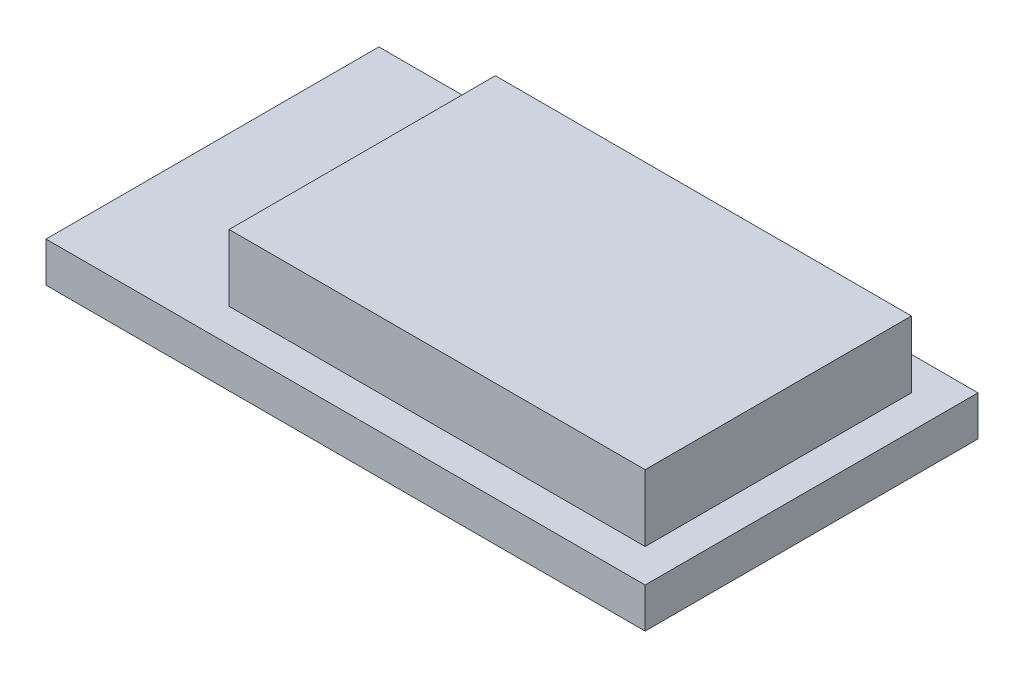
ISO-10303-21;
HEADER;
FILE_DESCRIPTION(('STEP AP214'),'2;1');
FILE_NAME('part.step','',(''),(''),'','','');
FILE_SCHEMA(('AUTOMOTIVE_DESIGN { 1 0 10303 214 1 1 1 1 }'));
ENDSEC;
DATA;
#1=APPLICATION_CONTEXT('core data for automotive mechanical design processes');
#2=APPLICATION_PROTOCOL_DEFINITION('international standard','automotive_design',2000,#1);
#3=PRODUCT_CONTEXT('',#1,'mechanical');
#4=PRODUCT('Part','Part','',(#3));
#5=PRODUCT_RELATED_PRODUCT_CATEGORY('part','',(#4));
#6=PRODUCT_DEFINITION_FORMATION('','',#4);
#7=PRODUCT_DEFINITION_CONTEXT('part definition',#1,'design');
#8=PRODUCT_DEFINITION('design','',#6,#7);
#9=PRODUCT_DEFINITION_SHAPE('','',#8);
#10=(LENGTH_UNIT() NAMED_UNIT(*) SI_UNIT(.MILLI.,.METRE.));
#11=(NAMED_UNIT(*) PLANE_ANGLE_UNIT() SI_UNIT($,.RADIAN.));
#12=(NAMED_UNIT(*) SI_UNIT($,.STERADIAN.) SOLID_ANGLE_UNIT());
#13=UNCERTAINTY_MEASURE_WITH_UNIT(LENGTH_MEASURE(1.E-05),#10,'distance_accuracy_value','');
#14=(GEOMETRIC_REPRESENTATION_CONTEXT(3) GLOBAL_UNCERTAINTY_ASSIGNED_CONTEXT((#13)) GLOBAL_UNIT_ASSIGNED_CONTEXT((#10,
#11,#12)) REPRESENTATION_CONTEXT('',''));
#15=CARTESIAN_POINT('',(0.,0.,0.));
#16=DIRECTION('',(0.,0.,1.));
#17=DIRECTION('',(1.,0.,0.));
#18=AXIS2_PLACEMENT_3D('',#15,#16,#17);
#19=CARTESIAN_POINT('',(0.,0.,0.));
#20=DIRECTION('',(0.,-1.,0.));
#21=DIRECTION('',(0.,0.,-1.));
#22=AXIS2_PLACEMENT_3D('',#19,#20,#21);
#23=PLANE('',#22);
#24=DIRECTION('',(0.,0.,1.));
#25=VECTOR('',#24,1.);
#26=CARTESIAN_POINT('',(-9.,0.,-5.));
#27=LINE('',#26,#25);
#28=CARTESIAN_POINT('',(-9.,0.,-5.));
#29=VERTEX_POINT('',#28);
#30=CARTESIAN_POINT('',(-9.,0.,5.));
#31=VERTEX_POINT('',#30);
#32=EDGE_CURVE('E120',#29,#31,#27,.T.);
#33=ORIENTED_EDGE('',*,*,#32,.T.);
#34=DIRECTION('',(1.,0.,0.));
#35=VECTOR('',#34,1.);
#36=CARTESIAN_POINT('',(9.,0.,5.));
#37=LINE('',#36,#35);
#38=CARTESIAN_POINT('',(9.,0.,5.));
#39=VERTEX_POINT('',#38);
#40=EDGE_CURVE('E123',#31,#39,#37,.T.);
#41=ORIENTED_EDGE('',*,*,#40,.T.);
#42=DIRECTION('',(0.,0.,-1.));
#43=VECTOR('',#42,1.);
#44=CARTESIAN_POINT('',(9.,0.,-5.));
#45=LINE('',#44,#43);
#46=CARTESIAN_POINT('',(9.,0.,-5.));
#47=VERTEX_POINT('',#46);
#48=EDGE_CURVE('E144',#39,#47,#45,.T.);
#49=ORIENTED_EDGE('',*,*,#48,.T.);
#50=DIRECTION('',(-1.,0.,0.));
#51=VECTOR('',#50,1.);
#52=CARTESIAN_POINT('',(9.,0.,-5.));
#53=LINE('',#52,#51);
#54=EDGE_CURVE('E133',#47,#29,#53,.T.);
#55=ORIENTED_EDGE('',*,*,#54,.T.);
#56=EDGE_LOOP('',(#33,#41,#49,#55));
#57=FACE_BOUND('',#56,.T.);
#58=DIRECTION('',(-1.,0.,0.));
#59=VECTOR('',#58,1.);
#60=CARTESIAN_POINT('',(8.,0.,-4.));
#61=LINE('',#60,#59);
#62=CARTESIAN_POINT('',(8.,0.,-4.));
#63=VERTEX_POINT('',#62);
#64=CARTESIAN_POINT('',(-4.5,0.,-4.));
#65=VERTEX_POINT('',#64);
#66=EDGE_CURVE('E119',#63,#65,#61,.T.);
#67=ORIENTED_EDGE('',*,*,#66,.F.);
#68=DIRECTION('',(0.,0.,-1.));
#69=VECTOR('',#68,1.);
#70=CARTESIAN_POINT('',(8.,0.,4.));
#71=LINE('',#70,#69);
#72=CARTESIAN_POINT('',(8.00000000000001,0.,4.));
#73=VERTEX_POINT('',#72);
#74=EDGE_CURVE('E116',#73,#63,#71,.T.);
#75=ORIENTED_EDGE('',*,*,#74,.F.);
#76=DIRECTION('',(1.,0.,0.));
#77=VECTOR('',#76,1.);
#78=CARTESIAN_POINT('',(-4.5,0.,4.));
#79=LINE('',#78,#77);
#80=CARTESIAN_POINT('',(-4.5,0.,4.));
#81=VERTEX_POINT('',#80);
#82=EDGE_CURVE('E55',#81,#73,#79,.T.);
#83=ORIENTED_EDGE('',*,*,#82,.F.);
#84=DIRECTION('',(0.,0.,1.));
#85=VECTOR('',#84,1.);
#86=CARTESIAN_POINT('',(-4.5,0.,-4.));
#87=LINE('',#86,#85);
#88=EDGE_CURVE('E50',#65,#81,#87,.T.);
#89=ORIENTED_EDGE('',*,*,#88,.F.);
#90=EDGE_LOOP('',(#67,#75,#83,#89));
#91=FACE_BOUND('',#90,.T.);
#92=ADVANCED_FACE('F33',(#57,#91),#23,.F.);
#93=CARTESIAN_POINT('',(-9.,-1.2,-5.));
#94=DIRECTION('',(-1.,0.,0.));
#95=DIRECTION('',(0.,0.,1.));
#96=AXIS2_PLACEMENT_3D('',#93,#94,#95);
#97=PLANE('',#96);
#98=ORIENTED_EDGE('',*,*,#32,.F.);
#99=DIRECTION('',(0.,1.,0.));
#100=VECTOR('',#99,1.);
#101=CARTESIAN_POINT('',(-9.,-1.2,-5.));
#102=LINE('',#101,#100);
#103=CARTESIAN_POINT('',(-9.,-1.2,-5.));
#104=VERTEX_POINT('',#103);
#105=EDGE_CURVE('E11',#104,#29,#102,.T.);
#106=ORIENTED_EDGE('',*,*,#105,.F.);
#107=DIRECTION('',(0.,0.,1.));
#108=VECTOR('',#107,1.);
#109=CARTESIAN_POINT('',(-9.,-1.2,-5.));
#110=LINE('',#109,#108);
#111=CARTESIAN_POINT('',(-9.,-1.2,5.));
#112=VERTEX_POINT('',#111);
#113=EDGE_CURVE('E129',#104,#112,#110,.T.);
#114=ORIENTED_EDGE('',*,*,#113,.T.);
#115=DIRECTION('',(0.,1.,0.));
#116=VECTOR('',#115,1.);
#117=CARTESIAN_POINT('',(-9.,-1.2,5.));
#118=LINE('',#117,#116);
#119=EDGE_CURVE('E37',#112,#31,#118,.T.);
#120=ORIENTED_EDGE('',*,*,#119,.T.);
#121=EDGE_LOOP('',(#98,#106,#114,#120));
#122=FACE_BOUND('',#121,.T.);
#123=ADVANCED_FACE('F35',(#122),#97,.T.);
#124=CARTESIAN_POINT('',(9.,-1.2,-5.));
#125=DIRECTION('',(0.,0.,-1.));
#126=DIRECTION('',(-1.,0.,0.));
#127=AXIS2_PLACEMENT_3D('',#124,#125,#126);
#128=PLANE('',#127);
#129=ORIENTED_EDGE('',*,*,#54,.F.);
#130=DIRECTION('',(0.,1.,0.));
#131=VECTOR('',#130,1.);
#132=CARTESIAN_POINT('',(9.,-1.2,-5.));
#133=LINE('',#132,#131);
#134=CARTESIAN_POINT('',(9.,-1.2,-5.));
#135=VERTEX_POINT('',#134);
#136=EDGE_CURVE('E42',#135,#47,#133,.T.);
#137=ORIENTED_EDGE('',*,*,#136,.F.);
#138=DIRECTION('',(-1.,0.,0.));
#139=VECTOR('',#138,1.);
#140=CARTESIAN_POINT('',(9.,-1.2,-5.));
#141=LINE('',#140,#139);
#142=EDGE_CURVE('E139',#135,#104,#141,.T.);
#143=ORIENTED_EDGE('',*,*,#142,.T.);
#144=ORIENTED_EDGE('',*,*,#105,.T.);
#145=EDGE_LOOP('',(#129,#137,#143,#144));
#146=FACE_BOUND('',#145,.T.);
#147=ADVANCED_FACE('F161',(#146),#128,.T.);
#148=CARTESIAN_POINT('',(9.,-1.2,-5.));
#149=DIRECTION('',(1.,0.,0.));
#150=DIRECTION('',(0.,0.,-1.));
#151=AXIS2_PLACEMENT_3D('',#148,#149,#150);
#152=PLANE('',#151);
#153=ORIENTED_EDGE('',*,*,#48,.F.);
#154=DIRECTION('',(0.,1.,0.));
#155=VECTOR('',#154,1.);
#156=CARTESIAN_POINT('',(9.,-1.2,5.));
#157=LINE('',#156,#155);
#158=CARTESIAN_POINT('',(9.,-1.2,5.));
#159=VERTEX_POINT('',#158);
#160=EDGE_CURVE('E149',#159,#39,#157,.T.);
#161=ORIENTED_EDGE('',*,*,#160,.F.);
#162=DIRECTION('',(0.,0.,-1.));
#163=VECTOR('',#162,1.);
#164=CARTESIAN_POINT('',(9.,-1.2,-5.));
#165=LINE('',#164,#163);
#166=EDGE_CURVE('E136',#159,#135,#165,.T.);
#167=ORIENTED_EDGE('',*,*,#166,.T.);
#168=ORIENTED_EDGE('',*,*,#136,.T.);
#169=EDGE_LOOP('',(#153,#161,#167,#168));
#170=FACE_BOUND('',#169,.T.);
#171=ADVANCED_FACE('F167',(#170),#152,.T.);
#172=CARTESIAN_POINT('',(9.,-1.2,5.));
#173=DIRECTION('',(0.,0.,1.));
#174=DIRECTION('',(1.,0.,0.));
#175=AXIS2_PLACEMENT_3D('',#172,#173,#174);
#176=PLANE('',#175);
#177=ORIENTED_EDGE('',*,*,#40,.F.);
#178=ORIENTED_EDGE('',*,*,#119,.F.);
#179=DIRECTION('',(1.,0.,0.));
#180=VECTOR('',#179,1.);
#181=CARTESIAN_POINT('',(9.,-1.2,5.));
#182=LINE('',#181,#180);
#183=EDGE_CURVE('E132',#112,#159,#182,.T.);
#184=ORIENTED_EDGE('',*,*,#183,.T.);
#185=ORIENTED_EDGE('',*,*,#160,.T.);
#186=EDGE_LOOP('',(#177,#178,#184,#185));
#187=FACE_BOUND('',#186,.T.);
#188=ADVANCED_FACE('F157',(#187),#176,.T.);
#189=CARTESIAN_POINT('',(0.,-1.2,0.));
#190=DIRECTION('',(0.,-1.,0.));
#191=DIRECTION('',(0.,0.,-1.));
#192=AXIS2_PLACEMENT_3D('',#189,#190,#191);
#193=PLANE('',#192);
#194=ORIENTED_EDGE('',*,*,#113,.F.);
#195=ORIENTED_EDGE('',*,*,#142,.F.);
#196=ORIENTED_EDGE('',*,*,#166,.F.);
#197=ORIENTED_EDGE('',*,*,#183,.F.);
#198=EDGE_LOOP('',(#194,#195,#196,#197));
#199=FACE_BOUND('',#198,.T.);
#200=ADVANCED_FACE('F164',(#199),#193,.T.);
#201=CARTESIAN_POINT('',(8.,2.,-4.));
#202=DIRECTION('',(0.,0.,1.));
#203=DIRECTION('',(1.,0.,0.));
#204=AXIS2_PLACEMENT_3D('',#201,#202,#203);
#205=PLANE('',#204);
#206=ORIENTED_EDGE('',*,*,#66,.T.);
#207=DIRECTION('',(0.,-1.,0.));
#208=VECTOR('',#207,1.);
#209=CARTESIAN_POINT('',(-4.5,2.,-4.));
#210=LINE('',#209,#208);
#211=CARTESIAN_POINT('',(-4.5,2.,-4.));
#212=VERTEX_POINT('',#211);
#213=EDGE_CURVE('E100',#212,#65,#210,.T.);
#214=ORIENTED_EDGE('',*,*,#213,.F.);
#215=DIRECTION('',(-1.,0.,0.));
#216=VECTOR('',#215,1.);
#217=CARTESIAN_POINT('',(8.,2.,-4.));
#218=LINE('',#217,#216);
#219=CARTESIAN_POINT('',(8.,2.,-4.));
#220=VERTEX_POINT('',#219);
#221=EDGE_CURVE('E107',#220,#212,#218,.T.);
#222=ORIENTED_EDGE('',*,*,#221,.F.);
#223=DIRECTION('',(0.,-1.,0.));
#224=VECTOR('',#223,1.);
#225=CARTESIAN_POINT('',(8.,2.,-4.));
#226=LINE('',#225,#224);
#227=EDGE_CURVE('E260',#220,#63,#226,.T.);
#228=ORIENTED_EDGE('',*,*,#227,.T.);
#229=EDGE_LOOP('',(#206,#214,#222,#228));
#230=FACE_BOUND('',#229,.T.);
#231=ADVANCED_FACE('F118',(#230),#205,.F.);
#232=CARTESIAN_POINT('',(-4.5,2.,-4.));
#233=DIRECTION('',(1.,0.,0.));
#234=DIRECTION('',(0.,0.,-1.));
#235=AXIS2_PLACEMENT_3D('',#232,#233,#234);
#236=PLANE('',#235);
#237=ORIENTED_EDGE('',*,*,#88,.T.);
#238=DIRECTION('',(0.,-1.,0.));
#239=VECTOR('',#238,1.);
#240=CARTESIAN_POINT('',(-4.5,2.,4.));
#241=LINE('',#240,#239);
#242=CARTESIAN_POINT('',(-4.5,2.,4.));
#243=VERTEX_POINT('',#242);
#244=EDGE_CURVE('E103',#243,#81,#241,.T.);
#245=ORIENTED_EDGE('',*,*,#244,.F.);
#246=DIRECTION('',(0.,0.,1.));
#247=VECTOR('',#246,1.);
#248=CARTESIAN_POINT('',(-4.5,2.,-4.));
#249=LINE('',#248,#247);
#250=EDGE_CURVE('E96',#212,#243,#249,.T.);
#251=ORIENTED_EDGE('',*,*,#250,.F.);
#252=ORIENTED_EDGE('',*,*,#213,.T.);
#253=EDGE_LOOP('',(#237,#245,#251,#252));
#254=FACE_BOUND('',#253,.T.);
#255=ADVANCED_FACE('F98',(#254),#236,.F.);
#256=CARTESIAN_POINT('',(-4.5,2.,4.));
#257=DIRECTION('',(0.,0.,-1.));
#258=DIRECTION('',(-1.,0.,0.));
#259=AXIS2_PLACEMENT_3D('',#256,#257,#258);
#260=PLANE('',#259);
#261=ORIENTED_EDGE('',*,*,#82,.T.);
#262=DIRECTION('',(0.,-1.,0.));
#263=VECTOR('',#262,1.);
#264=CARTESIAN_POINT('',(8.,2.,4.));
#265=LINE('',#264,#263);
#266=CARTESIAN_POINT('',(8.,2.,4.));
#267=VERTEX_POINT('',#266);
#268=EDGE_CURVE('E125',#267,#73,#265,.T.);
#269=ORIENTED_EDGE('',*,*,#268,.F.);
#270=DIRECTION('',(1.,0.,0.));
#271=VECTOR('',#270,1.);
#272=CARTESIAN_POINT('',(-4.5,2.,4.));
#273=LINE('',#272,#271);
#274=EDGE_CURVE('E106',#243,#267,#273,.T.);
#275=ORIENTED_EDGE('',*,*,#274,.F.);
#276=ORIENTED_EDGE('',*,*,#244,.T.);
#277=EDGE_LOOP('',(#261,#269,#275,#276));
#278=FACE_BOUND('',#277,.T.);
#279=ADVANCED_FACE('F187',(#278),#260,.F.);
#280=CARTESIAN_POINT('',(8.,2.,4.));
#281=DIRECTION('',(-1.,0.,0.));
#282=DIRECTION('',(0.,0.,1.));
#283=AXIS2_PLACEMENT_3D('',#280,#281,#282);
#284=PLANE('',#283);
#285=ORIENTED_EDGE('',*,*,#74,.T.);
#286=ORIENTED_EDGE('',*,*,#227,.F.);
#287=DIRECTION('',(0.,0.,-1.));
#288=VECTOR('',#287,1.);
#289=CARTESIAN_POINT('',(8.,2.,4.));
#290=LINE('',#289,#288);
#291=EDGE_CURVE('E112',#267,#220,#290,.T.);
#292=ORIENTED_EDGE('',*,*,#291,.F.);
#293=ORIENTED_EDGE('',*,*,#268,.T.);
#294=EDGE_LOOP('',(#285,#286,#292,#293));
#295=FACE_BOUND('',#294,.T.);
#296=ADVANCED_FACE('F190',(#295),#284,.F.);
#297=CARTESIAN_POINT('',(0.,2.,0.));
#298=DIRECTION('',(0.,1.,0.));
#299=DIRECTION('',(0.,0.,1.));
#300=AXIS2_PLACEMENT_3D('',#297,#298,#299);
#301=PLANE('',#300);
#302=ORIENTED_EDGE('',*,*,#221,.T.);
#303=ORIENTED_EDGE('',*,*,#250,.T.);
#304=ORIENTED_EDGE('',*,*,#274,.T.);
#305=ORIENTED_EDGE('',*,*,#291,.T.);
#306=EDGE_LOOP('',(#302,#303,#304,#305));
#307=FACE_BOUND('',#306,.T.);
#308=ADVANCED_FACE('F110',(#307),#301,.T.);
#309=CLOSED_SHELL('',(#92,#123,#147,#171,#188,#200,#231,#255,#279,#296,#308));
#310=MANIFOLD_SOLID_BREP('B2',#309);
#311=ADVANCED_BREP_SHAPE_REPRESENTATION('',(#18,#310),#14);
#312=SHAPE_DEFINITION_REPRESENTATION(#9,#311);
ENDSEC;
END-ISO-10303-21;
